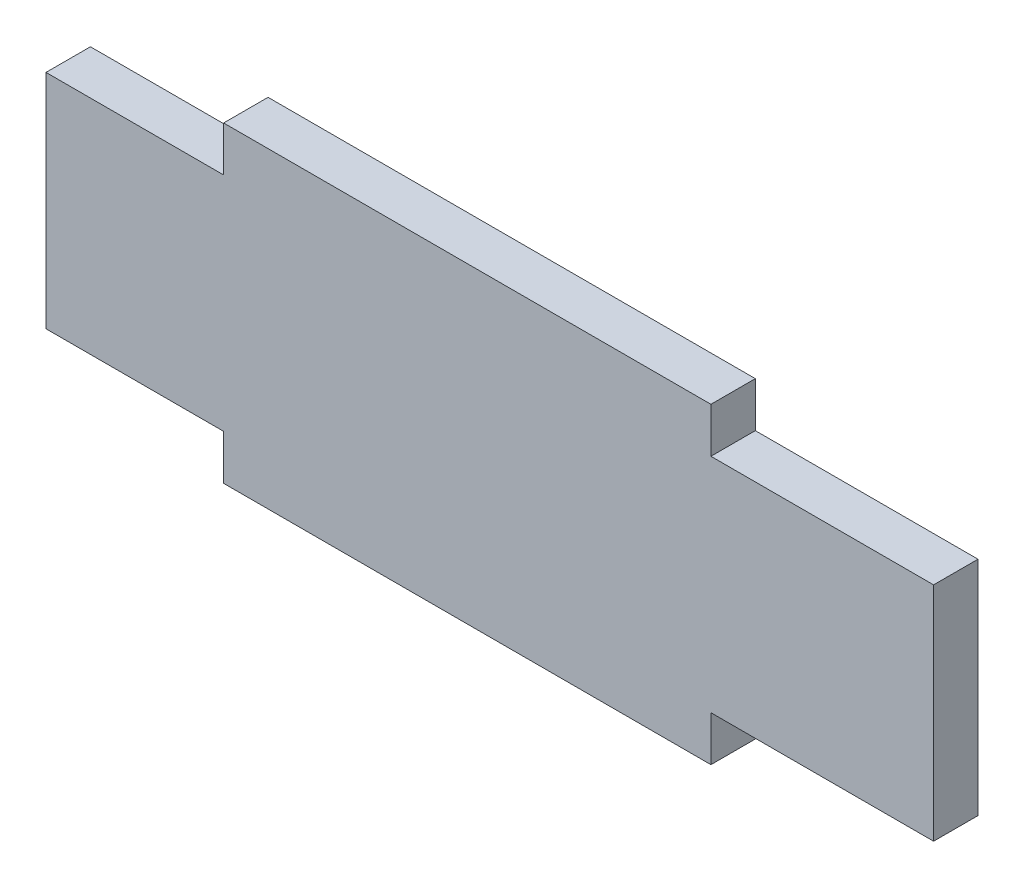
ISO-10303-21;
HEADER;
FILE_DESCRIPTION(('STEP AP214'),'2;1');
FILE_NAME('part.step','',(''),(''),'','','');
FILE_SCHEMA(('AUTOMOTIVE_DESIGN { 1 0 10303 214 1 1 1 1 }'));
ENDSEC;
DATA;
#1=APPLICATION_CONTEXT('core data for automotive mechanical design processes');
#2=APPLICATION_PROTOCOL_DEFINITION('international standard','automotive_design',2000,#1);
#3=PRODUCT_CONTEXT('',#1,'mechanical');
#4=PRODUCT('Part','Part','',(#3));
#5=PRODUCT_RELATED_PRODUCT_CATEGORY('part','',(#4));
#6=PRODUCT_DEFINITION_FORMATION('','',#4);
#7=PRODUCT_DEFINITION_CONTEXT('part definition',#1,'design');
#8=PRODUCT_DEFINITION('design','',#6,#7);
#9=PRODUCT_DEFINITION_SHAPE('','',#8);
#10=(LENGTH_UNIT() NAMED_UNIT(*) SI_UNIT(.MILLI.,.METRE.));
#11=(NAMED_UNIT(*) PLANE_ANGLE_UNIT() SI_UNIT($,.RADIAN.));
#12=(NAMED_UNIT(*) SI_UNIT($,.STERADIAN.) SOLID_ANGLE_UNIT());
#13=UNCERTAINTY_MEASURE_WITH_UNIT(LENGTH_MEASURE(1.E-05),#10,'distance_accuracy_value','');
#14=(GEOMETRIC_REPRESENTATION_CONTEXT(3) GLOBAL_UNCERTAINTY_ASSIGNED_CONTEXT((#13)) GLOBAL_UNIT_ASSIGNED_CONTEXT((#10,
#11,#12)) REPRESENTATION_CONTEXT('',''));
#15=CARTESIAN_POINT('',(0.,0.,0.));
#16=DIRECTION('',(0.,0.,1.));
#17=DIRECTION('',(1.,0.,0.));
#18=AXIS2_PLACEMENT_3D('',#15,#16,#17);
#19=CARTESIAN_POINT('',(0.,0.,5.));
#20=DIRECTION('',(0.,1.,0.));
#21=DIRECTION('',(0.,0.,1.));
#22=AXIS2_PLACEMENT_3D('',#19,#20,#21);
#23=PLANE('',#22);
#24=DIRECTION('',(1.,0.,0.));
#25=VECTOR('',#24,1.);
#26=CARTESIAN_POINT('',(0.,0.,0.));
#27=LINE('',#26,#25);
#28=CARTESIAN_POINT('',(0.,0.,0.));
#29=VERTEX_POINT('',#28);
#30=CARTESIAN_POINT('',(20.,0.,0.));
#31=VERTEX_POINT('',#30);
#32=EDGE_CURVE('E212',#29,#31,#27,.T.);
#33=ORIENTED_EDGE('',*,*,#32,.T.);
#34=DIRECTION('',(0.,0.,-1.));
#35=VECTOR('',#34,1.);
#36=CARTESIAN_POINT('',(20.,0.,5.));
#37=LINE('',#36,#35);
#38=CARTESIAN_POINT('',(20.,0.,5.));
#39=VERTEX_POINT('',#38);
#40=EDGE_CURVE('E11',#39,#31,#37,.T.);
#41=ORIENTED_EDGE('',*,*,#40,.F.);
#42=DIRECTION('',(1.,0.,0.));
#43=VECTOR('',#42,1.);
#44=CARTESIAN_POINT('',(0.,0.,5.));
#45=LINE('',#44,#43);
#46=CARTESIAN_POINT('',(0.,0.,5.));
#47=VERTEX_POINT('',#46);
#48=EDGE_CURVE('E169',#47,#39,#45,.T.);
#49=ORIENTED_EDGE('',*,*,#48,.F.);
#50=DIRECTION('',(0.,0.,-1.));
#51=VECTOR('',#50,1.);
#52=CARTESIAN_POINT('',(0.,0.,5.));
#53=LINE('',#52,#51);
#54=EDGE_CURVE('E54',#47,#29,#53,.T.);
#55=ORIENTED_EDGE('',*,*,#54,.T.);
#56=EDGE_LOOP('',(#33,#41,#49,#55));
#57=FACE_BOUND('',#56,.T.);
#58=ADVANCED_FACE('F37',(#57),#23,.F.);
#59=CARTESIAN_POINT('',(20.,0.,5.));
#60=DIRECTION('',(1.,0.,0.));
#61=DIRECTION('',(0.,0.,-1.));
#62=AXIS2_PLACEMENT_3D('',#59,#60,#61);
#63=PLANE('',#62);
#64=DIRECTION('',(0.,-1.,0.));
#65=VECTOR('',#64,1.);
#66=CARTESIAN_POINT('',(20.,0.,0.));
#67=LINE('',#66,#65);
#68=CARTESIAN_POINT('',(20.,-5.06999999999997,0.));
#69=VERTEX_POINT('',#68);
#70=EDGE_CURVE('E211',#31,#69,#67,.T.);
#71=ORIENTED_EDGE('',*,*,#70,.T.);
#72=DIRECTION('',(0.,0.,-1.));
#73=VECTOR('',#72,1.);
#74=CARTESIAN_POINT('',(20.,-5.06999999999997,5.));
#75=LINE('',#74,#73);
#76=CARTESIAN_POINT('',(20.,-5.06999999999997,5.));
#77=VERTEX_POINT('',#76);
#78=EDGE_CURVE('E46',#77,#69,#75,.T.);
#79=ORIENTED_EDGE('',*,*,#78,.F.);
#80=DIRECTION('',(0.,-1.,0.));
#81=VECTOR('',#80,1.);
#82=CARTESIAN_POINT('',(20.,0.,5.));
#83=LINE('',#82,#81);
#84=EDGE_CURVE('E104',#39,#77,#83,.T.);
#85=ORIENTED_EDGE('',*,*,#84,.F.);
#86=ORIENTED_EDGE('',*,*,#40,.T.);
#87=EDGE_LOOP('',(#71,#79,#85,#86));
#88=FACE_BOUND('',#87,.T.);
#89=ADVANCED_FACE('F39',(#88),#63,.F.);
#90=CARTESIAN_POINT('',(0.,-5.06999999999996,5.));
#91=DIRECTION('',(0.,-1.,0.));
#92=DIRECTION('',(1.,0.,0.));
#93=AXIS2_PLACEMENT_3D('',#90,#91,#92);
#94=PLANE('',#93);
#95=DIRECTION('',(-1.,0.,0.));
#96=VECTOR('',#95,1.);
#97=CARTESIAN_POINT('',(0.,-5.06999999999996,0.));
#98=LINE('',#97,#96);
#99=CARTESIAN_POINT('',(74.86,-5.06999999999999,0.));
#100=VERTEX_POINT('',#99);
#101=EDGE_CURVE('E208',#100,#69,#98,.T.);
#102=ORIENTED_EDGE('',*,*,#101,.F.);
#103=DIRECTION('',(0.,0.,-1.));
#104=VECTOR('',#103,1.);
#105=CARTESIAN_POINT('',(74.86,-5.06999999999999,5.));
#106=LINE('',#105,#104);
#107=CARTESIAN_POINT('',(74.86,-5.06999999999999,5.));
#108=VERTEX_POINT('',#107);
#109=EDGE_CURVE('E202',#108,#100,#106,.T.);
#110=ORIENTED_EDGE('',*,*,#109,.F.);
#111=DIRECTION('',(-1.,0.,0.));
#112=VECTOR('',#111,1.);
#113=CARTESIAN_POINT('',(0.,-5.06999999999996,5.));
#114=LINE('',#113,#112);
#115=EDGE_CURVE('E173',#108,#77,#114,.T.);
#116=ORIENTED_EDGE('',*,*,#115,.T.);
#117=ORIENTED_EDGE('',*,*,#78,.T.);
#118=EDGE_LOOP('',(#102,#110,#116,#117));
#119=FACE_BOUND('',#118,.T.);
#120=ADVANCED_FACE('F206',(#119),#94,.T.);
#121=CARTESIAN_POINT('',(74.86,0.,5.));
#122=DIRECTION('',(1.,0.,0.));
#123=DIRECTION('',(0.,0.,-1.));
#124=AXIS2_PLACEMENT_3D('',#121,#122,#123);
#125=PLANE('',#124);
#126=DIRECTION('',(0.,-1.,0.));
#127=VECTOR('',#126,1.);
#128=CARTESIAN_POINT('',(74.86,0.,0.));
#129=LINE('',#128,#127);
#130=CARTESIAN_POINT('',(74.86,0.,0.));
#131=VERTEX_POINT('',#130);
#132=EDGE_CURVE('E217',#131,#100,#129,.T.);
#133=ORIENTED_EDGE('',*,*,#132,.F.);
#134=DIRECTION('',(0.,0.,-1.));
#135=VECTOR('',#134,1.);
#136=CARTESIAN_POINT('',(74.86,0.,5.));
#137=LINE('',#136,#135);
#138=CARTESIAN_POINT('',(74.86,0.,5.));
#139=VERTEX_POINT('',#138);
#140=EDGE_CURVE('E200',#139,#131,#137,.T.);
#141=ORIENTED_EDGE('',*,*,#140,.F.);
#142=DIRECTION('',(0.,-1.,0.));
#143=VECTOR('',#142,1.);
#144=CARTESIAN_POINT('',(74.86,0.,5.));
#145=LINE('',#144,#143);
#146=EDGE_CURVE('E167',#139,#108,#145,.T.);
#147=ORIENTED_EDGE('',*,*,#146,.T.);
#148=ORIENTED_EDGE('',*,*,#109,.T.);
#149=EDGE_LOOP('',(#133,#141,#147,#148));
#150=FACE_BOUND('',#149,.T.);
#151=ADVANCED_FACE('F244',(#150),#125,.T.);
#152=CARTESIAN_POINT('',(99.93,0.,0.));
#153=VERTEX_POINT('',#152);
#154=EDGE_CURVE('E219',#131,#153,#27,.T.);
#155=ORIENTED_EDGE('',*,*,#154,.T.);
#156=DIRECTION('',(0.,0.,-1.));
#157=VECTOR('',#156,1.);
#158=CARTESIAN_POINT('',(99.93,0.,5.));
#159=LINE('',#158,#157);
#160=CARTESIAN_POINT('',(99.93,0.,5.));
#161=VERTEX_POINT('',#160);
#162=EDGE_CURVE('E197',#161,#153,#159,.T.);
#163=ORIENTED_EDGE('',*,*,#162,.F.);
#164=EDGE_CURVE('E164',#139,#161,#45,.T.);
#165=ORIENTED_EDGE('',*,*,#164,.F.);
#166=ORIENTED_EDGE('',*,*,#140,.T.);
#167=EDGE_LOOP('',(#155,#163,#165,#166));
#168=FACE_BOUND('',#167,.T.);
#169=ADVANCED_FACE('F247',(#168),#23,.F.);
#170=CARTESIAN_POINT('',(99.93,0.,5.));
#171=DIRECTION('',(-1.,0.,0.));
#172=DIRECTION('',(0.,-1.,0.));
#173=AXIS2_PLACEMENT_3D('',#170,#171,#172);
#174=PLANE('',#173);
#175=DIRECTION('',(0.,1.,0.));
#176=VECTOR('',#175,1.);
#177=CARTESIAN_POINT('',(99.93,0.,0.));
#178=LINE('',#177,#176);
#179=CARTESIAN_POINT('',(99.93,25.,0.));
#180=VERTEX_POINT('',#179);
#181=EDGE_CURVE('E223',#153,#180,#178,.T.);
#182=ORIENTED_EDGE('',*,*,#181,.T.);
#183=DIRECTION('',(0.,0.,-1.));
#184=VECTOR('',#183,1.);
#185=CARTESIAN_POINT('',(99.93,25.,5.));
#186=LINE('',#185,#184);
#187=CARTESIAN_POINT('',(99.93,25.,5.));
#188=VERTEX_POINT('',#187);
#189=EDGE_CURVE('E195',#188,#180,#186,.T.);
#190=ORIENTED_EDGE('',*,*,#189,.F.);
#191=DIRECTION('',(0.,1.,0.));
#192=VECTOR('',#191,1.);
#193=CARTESIAN_POINT('',(99.93,0.,5.));
#194=LINE('',#193,#192);
#195=EDGE_CURVE('E161',#161,#188,#194,.T.);
#196=ORIENTED_EDGE('',*,*,#195,.F.);
#197=ORIENTED_EDGE('',*,*,#162,.T.);
#198=EDGE_LOOP('',(#182,#190,#196,#197));
#199=FACE_BOUND('',#198,.T.);
#200=ADVANCED_FACE('F240',(#199),#174,.F.);
#201=CARTESIAN_POINT('',(0.,25.,5.));
#202=DIRECTION('',(0.,1.,0.));
#203=DIRECTION('',(0.,0.,1.));
#204=AXIS2_PLACEMENT_3D('',#201,#202,#203);
#205=PLANE('',#204);
#206=DIRECTION('',(1.,0.,0.));
#207=VECTOR('',#206,1.);
#208=CARTESIAN_POINT('',(0.,25.,0.));
#209=LINE('',#208,#207);
#210=CARTESIAN_POINT('',(74.86,25.,0.));
#211=VERTEX_POINT('',#210);
#212=EDGE_CURVE('E183',#211,#180,#209,.T.);
#213=ORIENTED_EDGE('',*,*,#212,.F.);
#214=DIRECTION('',(0.,0.,-1.));
#215=VECTOR('',#214,1.);
#216=CARTESIAN_POINT('',(74.86,25.,5.));
#217=LINE('',#216,#215);
#218=CARTESIAN_POINT('',(74.86,25.,5.));
#219=VERTEX_POINT('',#218);
#220=EDGE_CURVE('E193',#219,#211,#217,.T.);
#221=ORIENTED_EDGE('',*,*,#220,.F.);
#222=DIRECTION('',(1.,0.,0.));
#223=VECTOR('',#222,1.);
#224=CARTESIAN_POINT('',(0.,25.,5.));
#225=LINE('',#224,#223);
#226=EDGE_CURVE('E155',#219,#188,#225,.T.);
#227=ORIENTED_EDGE('',*,*,#226,.T.);
#228=ORIENTED_EDGE('',*,*,#189,.T.);
#229=EDGE_LOOP('',(#213,#221,#227,#228));
#230=FACE_BOUND('',#229,.T.);
#231=ADVANCED_FACE('F237',(#230),#205,.T.);
#232=CARTESIAN_POINT('',(74.86,0.,5.));
#233=DIRECTION('',(-1.,0.,0.));
#234=DIRECTION('',(0.,0.,1.));
#235=AXIS2_PLACEMENT_3D('',#232,#233,#234);
#236=PLANE('',#235);
#237=DIRECTION('',(0.,1.,0.));
#238=VECTOR('',#237,1.);
#239=CARTESIAN_POINT('',(74.86,0.,0.));
#240=LINE('',#239,#238);
#241=CARTESIAN_POINT('',(74.86,30.07,0.));
#242=VERTEX_POINT('',#241);
#243=EDGE_CURVE('E227',#211,#242,#240,.T.);
#244=ORIENTED_EDGE('',*,*,#243,.T.);
#245=DIRECTION('',(0.,0.,-1.));
#246=VECTOR('',#245,1.);
#247=CARTESIAN_POINT('',(74.86,30.07,5.));
#248=LINE('',#247,#246);
#249=CARTESIAN_POINT('',(74.86,30.07,5.));
#250=VERTEX_POINT('',#249);
#251=EDGE_CURVE('E190',#250,#242,#248,.T.);
#252=ORIENTED_EDGE('',*,*,#251,.F.);
#253=DIRECTION('',(0.,1.,0.));
#254=VECTOR('',#253,1.);
#255=CARTESIAN_POINT('',(74.86,0.,5.));
#256=LINE('',#255,#254);
#257=EDGE_CURVE('E160',#219,#250,#256,.T.);
#258=ORIENTED_EDGE('',*,*,#257,.F.);
#259=ORIENTED_EDGE('',*,*,#220,.T.);
#260=EDGE_LOOP('',(#244,#252,#258,#259));
#261=FACE_BOUND('',#260,.T.);
#262=ADVANCED_FACE('F277',(#261),#236,.F.);
#263=CARTESIAN_POINT('',(0.,30.07,5.));
#264=DIRECTION('',(0.,-1.,0.));
#265=DIRECTION('',(1.,0.,0.));
#266=AXIS2_PLACEMENT_3D('',#263,#264,#265);
#267=PLANE('',#266);
#268=DIRECTION('',(-1.,0.,0.));
#269=VECTOR('',#268,1.);
#270=CARTESIAN_POINT('',(0.,30.07,0.));
#271=LINE('',#270,#269);
#272=CARTESIAN_POINT('',(20.,30.07,0.));
#273=VERTEX_POINT('',#272);
#274=EDGE_CURVE('E228',#242,#273,#271,.T.);
#275=ORIENTED_EDGE('',*,*,#274,.T.);
#276=DIRECTION('',(0.,0.,-1.));
#277=VECTOR('',#276,1.);
#278=CARTESIAN_POINT('',(20.,30.07,5.));
#279=LINE('',#278,#277);
#280=CARTESIAN_POINT('',(20.,30.07,5.));
#281=VERTEX_POINT('',#280);
#282=EDGE_CURVE('E141',#281,#273,#279,.T.);
#283=ORIENTED_EDGE('',*,*,#282,.F.);
#284=DIRECTION('',(-1.,0.,0.));
#285=VECTOR('',#284,1.);
#286=CARTESIAN_POINT('',(0.,30.07,5.));
#287=LINE('',#286,#285);
#288=EDGE_CURVE('E149',#250,#281,#287,.T.);
#289=ORIENTED_EDGE('',*,*,#288,.F.);
#290=ORIENTED_EDGE('',*,*,#251,.T.);
#291=EDGE_LOOP('',(#275,#283,#289,#290));
#292=FACE_BOUND('',#291,.T.);
#293=ADVANCED_FACE('F274',(#292),#267,.F.);
#294=CARTESIAN_POINT('',(20.,0.,5.));
#295=DIRECTION('',(-1.,0.,0.));
#296=DIRECTION('',(0.,0.,1.));
#297=AXIS2_PLACEMENT_3D('',#294,#295,#296);
#298=PLANE('',#297);
#299=DIRECTION('',(0.,1.,0.));
#300=VECTOR('',#299,1.);
#301=CARTESIAN_POINT('',(20.,0.,0.));
#302=LINE('',#301,#300);
#303=CARTESIAN_POINT('',(20.,25.,0.));
#304=VERTEX_POINT('',#303);
#305=EDGE_CURVE('E137',#304,#273,#302,.T.);
#306=ORIENTED_EDGE('',*,*,#305,.F.);
#307=DIRECTION('',(0.,0.,-1.));
#308=VECTOR('',#307,1.);
#309=CARTESIAN_POINT('',(20.,25.,5.));
#310=LINE('',#309,#308);
#311=CARTESIAN_POINT('',(20.,25.,5.));
#312=VERTEX_POINT('',#311);
#313=EDGE_CURVE('E132',#312,#304,#310,.T.);
#314=ORIENTED_EDGE('',*,*,#313,.F.);
#315=DIRECTION('',(0.,1.,0.));
#316=VECTOR('',#315,1.);
#317=CARTESIAN_POINT('',(20.,0.,5.));
#318=LINE('',#317,#316);
#319=EDGE_CURVE('E135',#312,#281,#318,.T.);
#320=ORIENTED_EDGE('',*,*,#319,.T.);
#321=ORIENTED_EDGE('',*,*,#282,.T.);
#322=EDGE_LOOP('',(#306,#314,#320,#321));
#323=FACE_BOUND('',#322,.T.);
#324=ADVANCED_FACE('F134',(#323),#298,.T.);
#325=CARTESIAN_POINT('',(0.,25.,0.));
#326=VERTEX_POINT('',#325);
#327=EDGE_CURVE('E179',#326,#304,#209,.T.);
#328=ORIENTED_EDGE('',*,*,#327,.F.);
#329=DIRECTION('',(0.,0.,-1.));
#330=VECTOR('',#329,1.);
#331=CARTESIAN_POINT('',(0.,25.,5.));
#332=LINE('',#331,#330);
#333=CARTESIAN_POINT('',(0.,25.,5.));
#334=VERTEX_POINT('',#333);
#335=EDGE_CURVE('E92',#334,#326,#332,.T.);
#336=ORIENTED_EDGE('',*,*,#335,.F.);
#337=EDGE_CURVE('E147',#334,#312,#225,.T.);
#338=ORIENTED_EDGE('',*,*,#337,.T.);
#339=ORIENTED_EDGE('',*,*,#313,.T.);
#340=EDGE_LOOP('',(#328,#336,#338,#339));
#341=FACE_BOUND('',#340,.T.);
#342=ADVANCED_FACE('F152',(#341),#205,.T.);
#343=CARTESIAN_POINT('',(0.,0.,5.));
#344=DIRECTION('',(-1.,0.,0.));
#345=DIRECTION('',(0.,0.,1.));
#346=AXIS2_PLACEMENT_3D('',#343,#344,#345);
#347=PLANE('',#346);
#348=DIRECTION('',(0.,1.,0.));
#349=VECTOR('',#348,1.);
#350=CARTESIAN_POINT('',(0.,0.,0.));
#351=LINE('',#350,#349);
#352=EDGE_CURVE('E176',#29,#326,#351,.T.);
#353=ORIENTED_EDGE('',*,*,#352,.F.);
#354=ORIENTED_EDGE('',*,*,#54,.F.);
#355=DIRECTION('',(0.,1.,0.));
#356=VECTOR('',#355,1.);
#357=CARTESIAN_POINT('',(0.,0.,5.));
#358=LINE('',#357,#356);
#359=EDGE_CURVE('E153',#47,#334,#358,.T.);
#360=ORIENTED_EDGE('',*,*,#359,.T.);
#361=ORIENTED_EDGE('',*,*,#335,.T.);
#362=EDGE_LOOP('',(#353,#354,#360,#361));
#363=FACE_BOUND('',#362,.T.);
#364=ADVANCED_FACE('F261',(#363),#347,.T.);
#365=CARTESIAN_POINT('',(0.,0.,5.));
#366=DIRECTION('',(0.,0.,1.));
#367=DIRECTION('',(1.,0.,0.));
#368=AXIS2_PLACEMENT_3D('',#365,#366,#367);
#369=PLANE('',#368);
#370=ORIENTED_EDGE('',*,*,#48,.T.);
#371=ORIENTED_EDGE('',*,*,#84,.T.);
#372=ORIENTED_EDGE('',*,*,#115,.F.);
#373=ORIENTED_EDGE('',*,*,#146,.F.);
#374=ORIENTED_EDGE('',*,*,#164,.T.);
#375=ORIENTED_EDGE('',*,*,#195,.T.);
#376=ORIENTED_EDGE('',*,*,#226,.F.);
#377=ORIENTED_EDGE('',*,*,#257,.T.);
#378=ORIENTED_EDGE('',*,*,#288,.T.);
#379=ORIENTED_EDGE('',*,*,#319,.F.);
#380=ORIENTED_EDGE('',*,*,#337,.F.);
#381=ORIENTED_EDGE('',*,*,#359,.F.);
#382=EDGE_LOOP('',(#370,#371,#372,#373,#374,#375,#376,#377,#378,#379,#380,#381));
#383=FACE_BOUND('',#382,.T.);
#384=ADVANCED_FACE('F145',(#383),#369,.T.);
#385=CARTESIAN_POINT('',(0.,0.,0.));
#386=DIRECTION('',(0.,0.,1.));
#387=DIRECTION('',(1.,0.,0.));
#388=AXIS2_PLACEMENT_3D('',#385,#386,#387);
#389=PLANE('',#388);
#390=ORIENTED_EDGE('',*,*,#32,.F.);
#391=ORIENTED_EDGE('',*,*,#352,.T.);
#392=ORIENTED_EDGE('',*,*,#327,.T.);
#393=ORIENTED_EDGE('',*,*,#305,.T.);
#394=ORIENTED_EDGE('',*,*,#274,.F.);
#395=ORIENTED_EDGE('',*,*,#243,.F.);
#396=ORIENTED_EDGE('',*,*,#212,.T.);
#397=ORIENTED_EDGE('',*,*,#181,.F.);
#398=ORIENTED_EDGE('',*,*,#154,.F.);
#399=ORIENTED_EDGE('',*,*,#132,.T.);
#400=ORIENTED_EDGE('',*,*,#101,.T.);
#401=ORIENTED_EDGE('',*,*,#70,.F.);
#402=EDGE_LOOP('',(#390,#391,#392,#393,#394,#395,#396,#397,#398,#399,#400,#401));
#403=FACE_BOUND('',#402,.T.);
#404=ADVANCED_FACE('F214',(#403),#389,.F.);
#405=CLOSED_SHELL('',(#58,#89,#120,#151,#169,#200,#231,#262,#293,#324,#342,#364,#384,#404));
#406=MANIFOLD_SOLID_BREP('B2',#405);
#407=ADVANCED_BREP_SHAPE_REPRESENTATION('',(#18,#406),#14);
#408=SHAPE_DEFINITION_REPRESENTATION(#9,#407);
ENDSEC;
END-ISO-10303-21;
